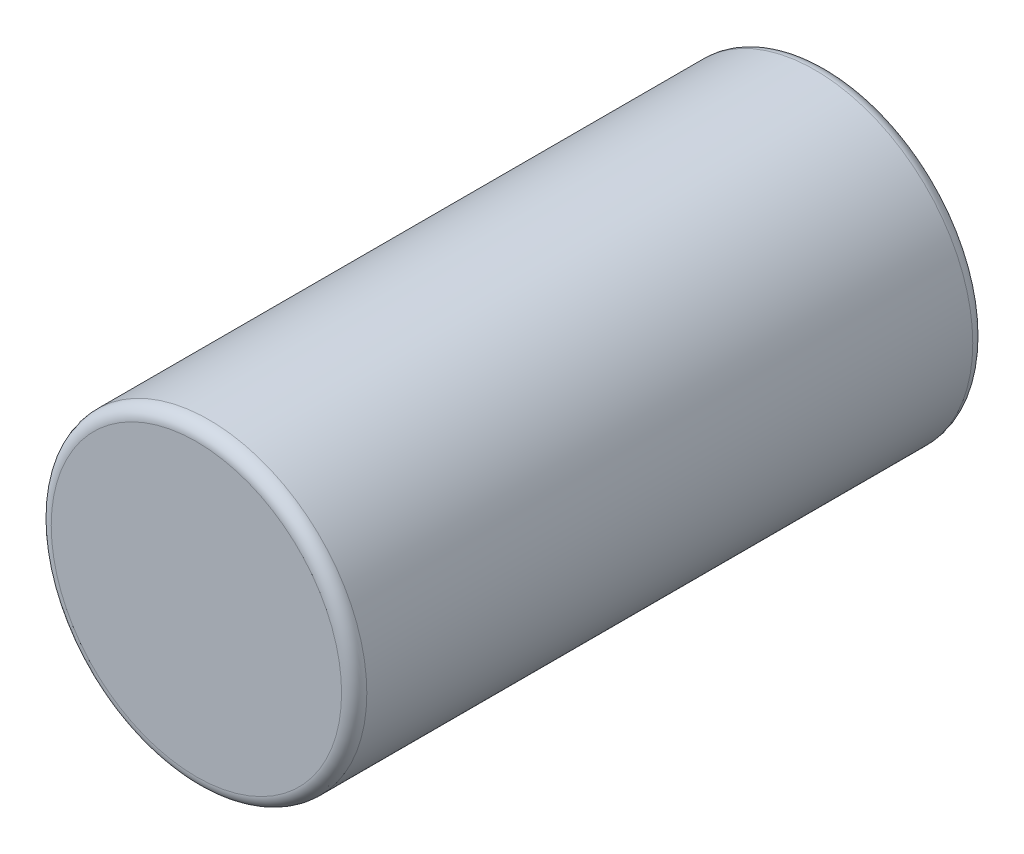
ISO-10303-21;
HEADER;
FILE_DESCRIPTION(('STEP AP214'),'2;1');
FILE_NAME('part.step','',(''),(''),'','','');
FILE_SCHEMA(('AUTOMOTIVE_DESIGN { 1 0 10303 214 1 1 1 1 }'));
ENDSEC;
DATA;
#1=APPLICATION_CONTEXT('core data for automotive mechanical design processes');
#2=APPLICATION_PROTOCOL_DEFINITION('international standard','automotive_design',2000,#1);
#3=PRODUCT_CONTEXT('',#1,'mechanical');
#4=PRODUCT('Part','Part','',(#3));
#5=PRODUCT_RELATED_PRODUCT_CATEGORY('part','',(#4));
#6=PRODUCT_DEFINITION_FORMATION('','',#4);
#7=PRODUCT_DEFINITION_CONTEXT('part definition',#1,'design');
#8=PRODUCT_DEFINITION('design','',#6,#7);
#9=PRODUCT_DEFINITION_SHAPE('','',#8);
#10=(LENGTH_UNIT() NAMED_UNIT(*) SI_UNIT(.MILLI.,.METRE.));
#11=(NAMED_UNIT(*) PLANE_ANGLE_UNIT() SI_UNIT($,.RADIAN.));
#12=(NAMED_UNIT(*) SI_UNIT($,.STERADIAN.) SOLID_ANGLE_UNIT());
#13=UNCERTAINTY_MEASURE_WITH_UNIT(LENGTH_MEASURE(1.E-05),#10,'distance_accuracy_value','');
#14=(GEOMETRIC_REPRESENTATION_CONTEXT(3) GLOBAL_UNCERTAINTY_ASSIGNED_CONTEXT((#13)) GLOBAL_UNIT_ASSIGNED_CONTEXT((#10,
#11,#12)) REPRESENTATION_CONTEXT('',''));
#15=CARTESIAN_POINT('',(0.,0.,0.));
#16=DIRECTION('',(0.,0.,1.));
#17=DIRECTION('',(1.,0.,0.));
#18=AXIS2_PLACEMENT_3D('',#15,#16,#17);
#19=CARTESIAN_POINT('',(0.,0.,12.7));
#20=DIRECTION('',(0.,0.,-1.));
#21=DIRECTION('',(-1.,0.,0.));
#22=AXIS2_PLACEMENT_3D('',#19,#20,#21);
#23=CYLINDRICAL_SURFACE('',#22,3.175);
#24=CARTESIAN_POINT('',(0.,0.,0.254000000000001));
#25=DIRECTION('',(0.,0.,1.));
#26=DIRECTION('',(1.,0.,0.));
#27=AXIS2_PLACEMENT_3D('',#24,#25,#26);
#28=CIRCLE('',#27,3.175);
#29=CARTESIAN_POINT('',(3.175,0.,0.254000000000001));
#30=VERTEX_POINT('',#29);
#31=EDGE_CURVE('E44',#30,#30,#28,.T.);
#32=ORIENTED_EDGE('',*,*,#31,.T.);
#33=EDGE_LOOP('',(#32));
#34=FACE_BOUND('',#33,.T.);
#35=CARTESIAN_POINT('',(0.,0.,12.446));
#36=DIRECTION('',(0.,0.,1.));
#37=DIRECTION('',(1.,0.,0.));
#38=AXIS2_PLACEMENT_3D('',#35,#36,#37);
#39=CIRCLE('',#38,3.175);
#40=CARTESIAN_POINT('',(3.175,0.,12.446));
#41=VERTEX_POINT('',#40);
#42=EDGE_CURVE('E48',#41,#41,#39,.F.);
#43=ORIENTED_EDGE('',*,*,#42,.T.);
#44=EDGE_LOOP('',(#43));
#45=FACE_BOUND('',#44,.T.);
#46=ADVANCED_FACE('F33',(#34,#45),#23,.T.);
#47=CARTESIAN_POINT('',(0.,0.,12.7));
#48=DIRECTION('',(0.,0.,1.));
#49=DIRECTION('',(1.,0.,0.));
#50=AXIS2_PLACEMENT_3D('',#47,#48,#49);
#51=PLANE('',#50);
#52=CARTESIAN_POINT('',(0.,0.,12.7));
#53=DIRECTION('',(0.,0.,1.));
#54=DIRECTION('',(1.,0.,0.));
#55=AXIS2_PLACEMENT_3D('',#52,#53,#54);
#56=CIRCLE('',#55,2.921);
#57=CARTESIAN_POINT('',(2.921,0.,12.7));
#58=VERTEX_POINT('',#57);
#59=EDGE_CURVE('E10',#58,#58,#56,.T.);
#60=ORIENTED_EDGE('',*,*,#59,.T.);
#61=EDGE_LOOP('',(#60));
#62=FACE_BOUND('',#61,.T.);
#63=ADVANCED_FACE('F64',(#62),#51,.T.);
#64=CARTESIAN_POINT('',(0.,0.,0.));
#65=DIRECTION('',(0.,0.,1.));
#66=DIRECTION('',(1.,0.,0.));
#67=AXIS2_PLACEMENT_3D('',#64,#65,#66);
#68=PLANE('',#67);
#69=CARTESIAN_POINT('',(0.,0.,0.));
#70=DIRECTION('',(0.,0.,1.));
#71=DIRECTION('',(1.,0.,0.));
#72=AXIS2_PLACEMENT_3D('',#69,#70,#71);
#73=CIRCLE('',#72,2.921);
#74=CARTESIAN_POINT('',(2.921,0.,0.));
#75=VERTEX_POINT('',#74);
#76=EDGE_CURVE('E40',#75,#75,#73,.F.);
#77=ORIENTED_EDGE('',*,*,#76,.T.);
#78=EDGE_LOOP('',(#77));
#79=FACE_BOUND('',#78,.T.);
#80=ADVANCED_FACE('F61',(#79),#68,.F.);
#81=CARTESIAN_POINT('',(0.,0.,0.254000000000001));
#82=DIRECTION('',(0.,0.,1.));
#83=DIRECTION('',(1.,0.,0.));
#84=AXIS2_PLACEMENT_3D('',#81,#82,#83);
#85=TOROIDAL_SURFACE('',#84,2.921,0.254);
#86=ORIENTED_EDGE('',*,*,#76,.F.);
#87=EDGE_LOOP('',(#86));
#88=FACE_BOUND('',#87,.T.);
#89=ORIENTED_EDGE('',*,*,#31,.F.);
#90=EDGE_LOOP('',(#89));
#91=FACE_BOUND('',#90,.T.);
#92=ADVANCED_FACE('F57',(#88,#91),#85,.T.);
#93=CARTESIAN_POINT('',(0.,0.,12.446));
#94=DIRECTION('',(0.,0.,1.));
#95=DIRECTION('',(1.,0.,0.));
#96=AXIS2_PLACEMENT_3D('',#93,#94,#95);
#97=TOROIDAL_SURFACE('',#96,2.921,0.254);
#98=ORIENTED_EDGE('',*,*,#42,.F.);
#99=EDGE_LOOP('',(#98));
#100=FACE_BOUND('',#99,.T.);
#101=ORIENTED_EDGE('',*,*,#59,.F.);
#102=EDGE_LOOP('',(#101));
#103=FACE_BOUND('',#102,.T.);
#104=ADVANCED_FACE('F35',(#100,#103),#97,.T.);
#105=CLOSED_SHELL('',(#46,#63,#80,#92,#104));
#106=MANIFOLD_SOLID_BREP('B2',#105);
#107=ADVANCED_BREP_SHAPE_REPRESENTATION('',(#18,#106),#14);
#108=SHAPE_DEFINITION_REPRESENTATION(#9,#107);
ENDSEC;
END-ISO-10303-21;
